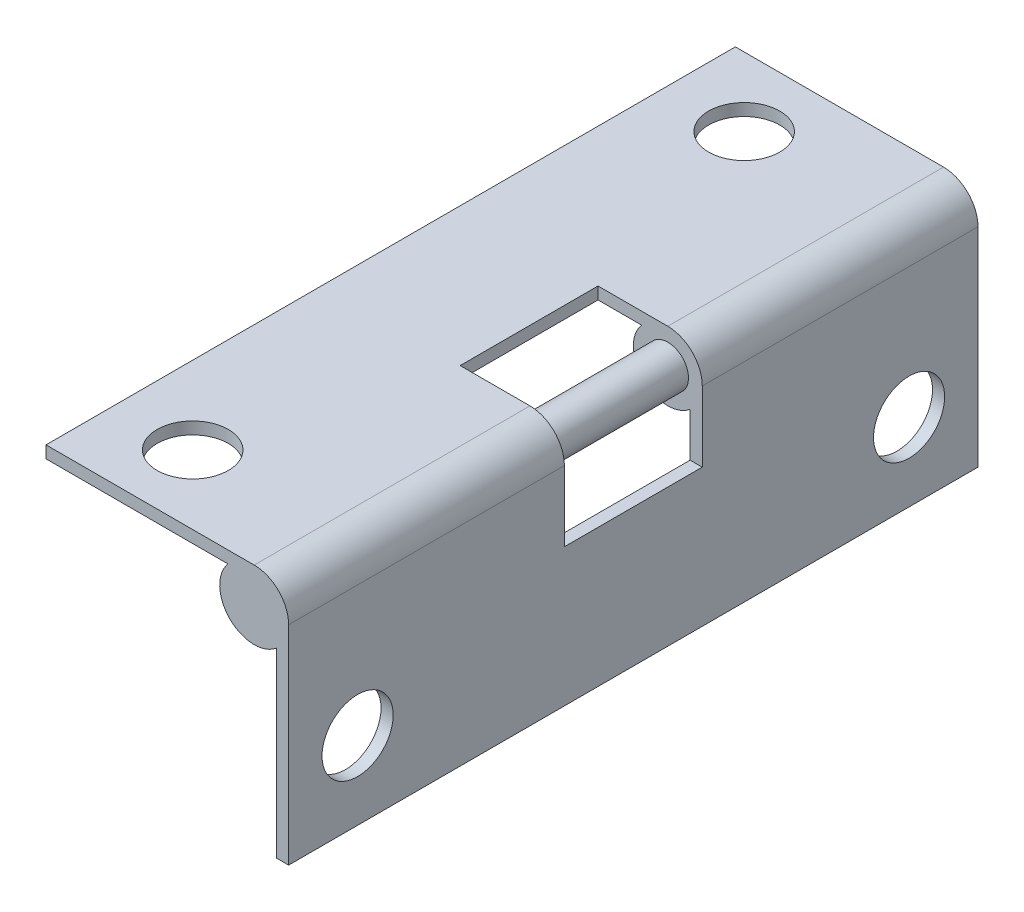
ISO-10303-21;
HEADER;
FILE_DESCRIPTION(('STEP AP214'),'2;1');
FILE_NAME('part.step','',(''),(''),'','','');
FILE_SCHEMA(('AUTOMOTIVE_DESIGN { 1 0 10303 214 1 1 1 1 }'));
ENDSEC;
DATA;
#1=APPLICATION_CONTEXT('core data for automotive mechanical design processes');
#2=APPLICATION_PROTOCOL_DEFINITION('international standard','automotive_design',2000,#1);
#3=PRODUCT_CONTEXT('',#1,'mechanical');
#4=PRODUCT('Part','Part','',(#3));
#5=PRODUCT_RELATED_PRODUCT_CATEGORY('part','',(#4));
#6=PRODUCT_DEFINITION_FORMATION('','',#4);
#7=PRODUCT_DEFINITION_CONTEXT('part definition',#1,'design');
#8=PRODUCT_DEFINITION('design','',#6,#7);
#9=PRODUCT_DEFINITION_SHAPE('','',#8);
#10=(LENGTH_UNIT() NAMED_UNIT(*) SI_UNIT(.MILLI.,.METRE.));
#11=(NAMED_UNIT(*) PLANE_ANGLE_UNIT() SI_UNIT($,.RADIAN.));
#12=(NAMED_UNIT(*) SI_UNIT($,.STERADIAN.) SOLID_ANGLE_UNIT());
#13=UNCERTAINTY_MEASURE_WITH_UNIT(LENGTH_MEASURE(1.E-05),#10,'distance_accuracy_value','');
#14=(GEOMETRIC_REPRESENTATION_CONTEXT(3) GLOBAL_UNCERTAINTY_ASSIGNED_CONTEXT((#13)) GLOBAL_UNIT_ASSIGNED_CONTEXT((#10,
#11,#12)) REPRESENTATION_CONTEXT('',''));
#15=CARTESIAN_POINT('',(0.,0.,0.));
#16=DIRECTION('',(0.,0.,1.));
#17=DIRECTION('',(1.,0.,0.));
#18=AXIS2_PLACEMENT_3D('',#15,#16,#17);
#19=CARTESIAN_POINT('',(0.,0.,31.75));
#20=DIRECTION('',(0.,0.,-1.));
#21=DIRECTION('',(-1.,0.,0.));
#22=AXIS2_PLACEMENT_3D('',#19,#20,#21);
#23=CYLINDRICAL_SURFACE('',#22,1.5875);
#24=CARTESIAN_POINT('',(0.,0.,12.7));
#25=DIRECTION('',(0.,0.,1.));
#26=DIRECTION('',(1.,0.,0.));
#27=AXIS2_PLACEMENT_3D('',#24,#25,#26);
#28=CIRCLE('',#27,1.5875);
#29=CARTESIAN_POINT('',(1.58749999999999,0.,12.7));
#30=VERTEX_POINT('',#29);
#31=CARTESIAN_POINT('',(0.,1.5875,12.7));
#32=VERTEX_POINT('',#31);
#33=EDGE_CURVE('E195',#30,#32,#28,.T.);
#34=ORIENTED_EDGE('',*,*,#33,.F.);
#35=DIRECTION('',(0.,0.,-1.));
#36=VECTOR('',#35,1.);
#37=CARTESIAN_POINT('',(1.5875,0.,31.75));
#38=LINE('',#37,#36);
#39=CARTESIAN_POINT('',(1.5875,0.,0.));
#40=VERTEX_POINT('',#39);
#41=EDGE_CURVE('E166',#30,#40,#38,.T.);
#42=ORIENTED_EDGE('',*,*,#41,.T.);
#43=CARTESIAN_POINT('',(0.,0.,0.));
#44=DIRECTION('',(0.,0.,1.));
#45=DIRECTION('',(1.,0.,0.));
#46=AXIS2_PLACEMENT_3D('',#43,#44,#45);
#47=CIRCLE('',#46,1.5875);
#48=CARTESIAN_POINT('',(0.,1.5875,0.));
#49=VERTEX_POINT('',#48);
#50=EDGE_CURVE('E216',#40,#49,#47,.T.);
#51=ORIENTED_EDGE('',*,*,#50,.T.);
#52=DIRECTION('',(0.,0.,-1.));
#53=VECTOR('',#52,1.);
#54=CARTESIAN_POINT('',(0.,1.5875,31.75));
#55=LINE('',#54,#53);
#56=EDGE_CURVE('E258',#32,#49,#55,.T.);
#57=ORIENTED_EDGE('',*,*,#56,.F.);
#58=EDGE_LOOP('',(#34,#42,#51,#57));
#59=FACE_BOUND('',#58,.T.);
#60=ADVANCED_FACE('F36',(#59),#23,.T.);
#61=CARTESIAN_POINT('',(0.,1.5875,31.75));
#62=DIRECTION('',(0.,-1.,0.));
#63=DIRECTION('',(1.,0.,0.));
#64=AXIS2_PLACEMENT_3D('',#61,#62,#63);
#65=PLANE('',#64);
#66=CARTESIAN_POINT('',(-6.0071,1.5875,28.575));
#67=DIRECTION('',(0.,1.,0.));
#68=DIRECTION('',(-1.,0.,0.));
#69=AXIS2_PLACEMENT_3D('',#66,#67,#68);
#70=CIRCLE('',#69,1.6383);
#71=CARTESIAN_POINT('',(-7.6454,1.5875,28.575));
#72=VERTEX_POINT('',#71);
#73=EDGE_CURVE('E178',#72,#72,#70,.T.);
#74=ORIENTED_EDGE('',*,*,#73,.F.);
#75=EDGE_LOOP('',(#74));
#76=FACE_BOUND('',#75,.T.);
#77=CARTESIAN_POINT('',(-6.0071,1.5875,3.175));
#78=DIRECTION('',(0.,1.,0.));
#79=DIRECTION('',(-1.,0.,0.));
#80=AXIS2_PLACEMENT_3D('',#77,#78,#79);
#81=CIRCLE('',#80,1.6383);
#82=CARTESIAN_POINT('',(-7.6454,1.5875,3.175));
#83=VERTEX_POINT('',#82);
#84=EDGE_CURVE('E169',#83,#83,#81,.T.);
#85=ORIENTED_EDGE('',*,*,#84,.F.);
#86=EDGE_LOOP('',(#85));
#87=FACE_BOUND('',#86,.T.);
#88=DIRECTION('',(1.,0.,0.));
#89=VECTOR('',#88,1.);
#90=CARTESIAN_POINT('',(0.,1.5875,12.7));
#91=LINE('',#90,#89);
#92=CARTESIAN_POINT('',(-3.2131,1.5875,12.7));
#93=VERTEX_POINT('',#92);
#94=EDGE_CURVE('E332',#93,#32,#91,.T.);
#95=ORIENTED_EDGE('',*,*,#94,.T.);
#96=ORIENTED_EDGE('',*,*,#56,.T.);
#97=DIRECTION('',(-1.,0.,0.));
#98=VECTOR('',#97,1.);
#99=CARTESIAN_POINT('',(0.,1.5875,0.));
#100=LINE('',#99,#98);
#101=CARTESIAN_POINT('',(-9.5885,1.5875,0.));
#102=VERTEX_POINT('',#101);
#103=EDGE_CURVE('E219',#49,#102,#100,.T.);
#104=ORIENTED_EDGE('',*,*,#103,.T.);
#105=DIRECTION('',(0.,0.,-1.));
#106=VECTOR('',#105,1.);
#107=CARTESIAN_POINT('',(-9.5885,1.5875,31.75));
#108=LINE('',#107,#106);
#109=CARTESIAN_POINT('',(-9.5885,1.5875,31.75));
#110=VERTEX_POINT('',#109);
#111=EDGE_CURVE('E255',#110,#102,#108,.T.);
#112=ORIENTED_EDGE('',*,*,#111,.F.);
#113=DIRECTION('',(-1.,0.,0.));
#114=VECTOR('',#113,1.);
#115=CARTESIAN_POINT('',(0.,1.5875,31.75));
#116=LINE('',#115,#114);
#117=CARTESIAN_POINT('',(0.,1.5875,31.75));
#118=VERTEX_POINT('',#117);
#119=EDGE_CURVE('E201',#118,#110,#116,.T.);
#120=ORIENTED_EDGE('',*,*,#119,.F.);
#121=CARTESIAN_POINT('',(0.,1.5875,19.05));
#122=VERTEX_POINT('',#121);
#123=EDGE_CURVE('E259',#118,#122,#55,.T.);
#124=ORIENTED_EDGE('',*,*,#123,.T.);
#125=DIRECTION('',(1.,0.,0.));
#126=VECTOR('',#125,1.);
#127=CARTESIAN_POINT('',(0.,1.5875,19.05));
#128=LINE('',#127,#126);
#129=CARTESIAN_POINT('',(-3.2131,1.5875,19.05));
#130=VERTEX_POINT('',#129);
#131=EDGE_CURVE('E338',#130,#122,#128,.T.);
#132=ORIENTED_EDGE('',*,*,#131,.F.);
#133=DIRECTION('',(0.,0.,1.));
#134=VECTOR('',#133,1.);
#135=CARTESIAN_POINT('',(-3.21310000000001,1.5875,0.));
#136=LINE('',#135,#134);
#137=EDGE_CURVE('E337',#93,#130,#136,.T.);
#138=ORIENTED_EDGE('',*,*,#137,.F.);
#139=EDGE_LOOP('',(#95,#96,#104,#112,#120,#124,#132,#138));
#140=FACE_BOUND('',#139,.T.);
#141=ADVANCED_FACE('F288',(#76,#87,#140),#65,.F.);
#142=CARTESIAN_POINT('',(-9.5885,1.0287,31.75));
#143=DIRECTION('',(0.,1.,0.));
#144=DIRECTION('',(-1.,0.,0.));
#145=AXIS2_PLACEMENT_3D('',#142,#143,#144);
#146=PLANE('',#145);
#147=CARTESIAN_POINT('',(-6.0071,1.0287,28.575));
#148=DIRECTION('',(0.,1.,0.));
#149=DIRECTION('',(-1.,0.,0.));
#150=AXIS2_PLACEMENT_3D('',#147,#148,#149);
#151=CIRCLE('',#150,1.6383);
#152=CARTESIAN_POINT('',(-7.6454,1.0287,28.575));
#153=VERTEX_POINT('',#152);
#154=EDGE_CURVE('E220',#153,#153,#151,.T.);
#155=ORIENTED_EDGE('',*,*,#154,.T.);
#156=EDGE_LOOP('',(#155));
#157=FACE_BOUND('',#156,.T.);
#158=CARTESIAN_POINT('',(-6.0071,1.0287,3.175));
#159=DIRECTION('',(0.,1.,0.));
#160=DIRECTION('',(-1.,0.,0.));
#161=AXIS2_PLACEMENT_3D('',#158,#159,#160);
#162=CIRCLE('',#161,1.6383);
#163=CARTESIAN_POINT('',(-7.6454,1.0287,3.175));
#164=VERTEX_POINT('',#163);
#165=EDGE_CURVE('E197',#164,#164,#162,.T.);
#166=ORIENTED_EDGE('',*,*,#165,.T.);
#167=EDGE_LOOP('',(#166));
#168=FACE_BOUND('',#167,.T.);
#169=DIRECTION('',(1.,0.,0.));
#170=VECTOR('',#169,1.);
#171=CARTESIAN_POINT('',(-9.5885,1.0287,12.7));
#172=LINE('',#171,#170);
#173=CARTESIAN_POINT('',(-3.2131,1.0287,12.7));
#174=VERTEX_POINT('',#173);
#175=CARTESIAN_POINT('',(-1.20910403191785,1.0287,12.7));
#176=VERTEX_POINT('',#175);
#177=EDGE_CURVE('E193',#174,#176,#172,.T.);
#178=ORIENTED_EDGE('',*,*,#177,.F.);
#179=DIRECTION('',(0.,0.,1.));
#180=VECTOR('',#179,1.);
#181=CARTESIAN_POINT('',(-3.2131,1.0287,31.75));
#182=LINE('',#181,#180);
#183=CARTESIAN_POINT('',(-3.2131,1.0287,19.05));
#184=VERTEX_POINT('',#183);
#185=EDGE_CURVE('E44',#174,#184,#182,.T.);
#186=ORIENTED_EDGE('',*,*,#185,.T.);
#187=DIRECTION('',(1.,0.,0.));
#188=VECTOR('',#187,1.);
#189=CARTESIAN_POINT('',(-9.5885,1.0287,19.05));
#190=LINE('',#189,#188);
#191=CARTESIAN_POINT('',(-1.20910403191785,1.0287,19.05));
#192=VERTEX_POINT('',#191);
#193=EDGE_CURVE('E184',#184,#192,#190,.T.);
#194=ORIENTED_EDGE('',*,*,#193,.T.);
#195=DIRECTION('',(0.,0.,-1.));
#196=VECTOR('',#195,1.);
#197=CARTESIAN_POINT('',(-1.20910403191785,1.0287,31.75));
#198=LINE('',#197,#196);
#199=CARTESIAN_POINT('',(-1.20910403191785,1.0287,31.75));
#200=VERTEX_POINT('',#199);
#201=EDGE_CURVE('E249',#200,#192,#198,.T.);
#202=ORIENTED_EDGE('',*,*,#201,.F.);
#203=DIRECTION('',(1.,0.,0.));
#204=VECTOR('',#203,1.);
#205=CARTESIAN_POINT('',(-9.5885,1.0287,31.75));
#206=LINE('',#205,#204);
#207=CARTESIAN_POINT('',(-9.5885,1.0287,31.75));
#208=VERTEX_POINT('',#207);
#209=EDGE_CURVE('E206',#208,#200,#206,.T.);
#210=ORIENTED_EDGE('',*,*,#209,.F.);
#211=DIRECTION('',(0.,0.,-1.));
#212=VECTOR('',#211,1.);
#213=CARTESIAN_POINT('',(-9.5885,1.0287,31.75));
#214=LINE('',#213,#212);
#215=CARTESIAN_POINT('',(-9.5885,1.0287,0.));
#216=VERTEX_POINT('',#215);
#217=EDGE_CURVE('E252',#208,#216,#214,.T.);
#218=ORIENTED_EDGE('',*,*,#217,.T.);
#219=DIRECTION('',(1.,0.,0.));
#220=VECTOR('',#219,1.);
#221=CARTESIAN_POINT('',(-9.5885,1.0287,0.));
#222=LINE('',#221,#220);
#223=CARTESIAN_POINT('',(-1.20910403191785,1.0287,0.));
#224=VERTEX_POINT('',#223);
#225=EDGE_CURVE('E224',#216,#224,#222,.T.);
#226=ORIENTED_EDGE('',*,*,#225,.T.);
#227=EDGE_CURVE('E248',#176,#224,#198,.T.);
#228=ORIENTED_EDGE('',*,*,#227,.F.);
#229=EDGE_LOOP('',(#178,#186,#194,#202,#210,#218,#226,#228));
#230=FACE_BOUND('',#229,.T.);
#231=ADVANCED_FACE('F268',(#157,#168,#230),#146,.F.);
#232=CARTESIAN_POINT('',(0.,0.,31.75));
#233=DIRECTION('',(0.,0.,-1.));
#234=DIRECTION('',(-1.,0.,0.));
#235=AXIS2_PLACEMENT_3D('',#232,#233,#234);
#236=CYLINDRICAL_SURFACE('',#235,1.5875);
#237=CARTESIAN_POINT('',(0.,0.,12.7));
#238=DIRECTION('',(0.,0.,1.));
#239=DIRECTION('',(1.,0.,0.));
#240=AXIS2_PLACEMENT_3D('',#237,#238,#239);
#241=CIRCLE('',#240,1.5875);
#242=CARTESIAN_POINT('',(1.0287,-1.20910403191785,12.7));
#243=VERTEX_POINT('',#242);
#244=EDGE_CURVE('E191',#176,#243,#241,.T.);
#245=ORIENTED_EDGE('',*,*,#244,.F.);
#246=ORIENTED_EDGE('',*,*,#227,.T.);
#247=CARTESIAN_POINT('',(0.,0.,0.));
#248=DIRECTION('',(0.,0.,1.));
#249=DIRECTION('',(1.,0.,0.));
#250=AXIS2_PLACEMENT_3D('',#247,#248,#249);
#251=CIRCLE('',#250,1.5875);
#252=CARTESIAN_POINT('',(1.0287,-1.20910403191785,0.));
#253=VERTEX_POINT('',#252);
#254=EDGE_CURVE('E227',#224,#253,#251,.T.);
#255=ORIENTED_EDGE('',*,*,#254,.T.);
#256=DIRECTION('',(0.,0.,-1.));
#257=VECTOR('',#256,1.);
#258=CARTESIAN_POINT('',(1.0287,-1.20910403191785,31.75));
#259=LINE('',#258,#257);
#260=EDGE_CURVE('E244',#243,#253,#259,.T.);
#261=ORIENTED_EDGE('',*,*,#260,.F.);
#262=EDGE_LOOP('',(#245,#246,#255,#261));
#263=FACE_BOUND('',#262,.T.);
#264=ADVANCED_FACE('F387',(#263),#236,.T.);
#265=CARTESIAN_POINT('',(1.0287,-9.5885,31.75));
#266=DIRECTION('',(1.,0.,0.));
#267=DIRECTION('',(0.,0.,-1.));
#268=AXIS2_PLACEMENT_3D('',#265,#266,#267);
#269=PLANE('',#268);
#270=CARTESIAN_POINT('',(1.0287,-6.0071,28.575));
#271=DIRECTION('',(1.,0.,0.));
#272=DIRECTION('',(0.,0.,-1.));
#273=AXIS2_PLACEMENT_3D('',#270,#271,#272);
#274=CIRCLE('',#273,1.6383);
#275=CARTESIAN_POINT('',(1.0287,-6.0071,26.9367));
#276=VERTEX_POINT('',#275);
#277=EDGE_CURVE('E342',#276,#276,#274,.T.);
#278=ORIENTED_EDGE('',*,*,#277,.T.);
#279=EDGE_LOOP('',(#278));
#280=FACE_BOUND('',#279,.T.);
#281=CARTESIAN_POINT('',(1.0287,-6.0071,3.175));
#282=DIRECTION('',(1.,0.,0.));
#283=DIRECTION('',(0.,0.,-1.));
#284=AXIS2_PLACEMENT_3D('',#281,#282,#283);
#285=CIRCLE('',#284,1.6383);
#286=CARTESIAN_POINT('',(1.0287,-6.0071,1.5367));
#287=VERTEX_POINT('',#286);
#288=EDGE_CURVE('E349',#287,#287,#285,.T.);
#289=ORIENTED_EDGE('',*,*,#288,.T.);
#290=EDGE_LOOP('',(#289));
#291=FACE_BOUND('',#290,.T.);
#292=DIRECTION('',(0.,-1.,0.));
#293=VECTOR('',#292,1.);
#294=CARTESIAN_POINT('',(1.0287,-9.5885,12.7));
#295=LINE('',#294,#293);
#296=CARTESIAN_POINT('',(1.0287,-3.2385,12.7));
#297=VERTEX_POINT('',#296);
#298=EDGE_CURVE('E153',#243,#297,#295,.T.);
#299=ORIENTED_EDGE('',*,*,#298,.F.);
#300=ORIENTED_EDGE('',*,*,#260,.T.);
#301=DIRECTION('',(0.,-1.,0.));
#302=VECTOR('',#301,1.);
#303=CARTESIAN_POINT('',(1.0287,-9.5885,0.));
#304=LINE('',#303,#302);
#305=CARTESIAN_POINT('',(1.0287,-9.5885,0.));
#306=VERTEX_POINT('',#305);
#307=EDGE_CURVE('E230',#253,#306,#304,.T.);
#308=ORIENTED_EDGE('',*,*,#307,.T.);
#309=DIRECTION('',(0.,0.,-1.));
#310=VECTOR('',#309,1.);
#311=CARTESIAN_POINT('',(1.0287,-9.5885,31.75));
#312=LINE('',#311,#310);
#313=CARTESIAN_POINT('',(1.0287,-9.5885,31.75));
#314=VERTEX_POINT('',#313);
#315=EDGE_CURVE('E241',#314,#306,#312,.T.);
#316=ORIENTED_EDGE('',*,*,#315,.F.);
#317=DIRECTION('',(0.,-1.,0.));
#318=VECTOR('',#317,1.);
#319=CARTESIAN_POINT('',(1.0287,-9.5885,31.75));
#320=LINE('',#319,#318);
#321=CARTESIAN_POINT('',(1.0287,-1.20910403191785,31.75));
#322=VERTEX_POINT('',#321);
#323=EDGE_CURVE('E210',#322,#314,#320,.T.);
#324=ORIENTED_EDGE('',*,*,#323,.F.);
#325=CARTESIAN_POINT('',(1.0287,-1.20910403191785,19.05));
#326=VERTEX_POINT('',#325);
#327=EDGE_CURVE('E245',#322,#326,#259,.T.);
#328=ORIENTED_EDGE('',*,*,#327,.T.);
#329=DIRECTION('',(0.,-1.,0.));
#330=VECTOR('',#329,1.);
#331=CARTESIAN_POINT('',(1.0287,-9.5885,19.05));
#332=LINE('',#331,#330);
#333=CARTESIAN_POINT('',(1.0287,-3.2385,19.05));
#334=VERTEX_POINT('',#333);
#335=EDGE_CURVE('E177',#326,#334,#332,.T.);
#336=ORIENTED_EDGE('',*,*,#335,.T.);
#337=DIRECTION('',(0.,0.,1.));
#338=VECTOR('',#337,1.);
#339=CARTESIAN_POINT('',(1.0287,-3.2385,31.75));
#340=LINE('',#339,#338);
#341=EDGE_CURVE('E175',#297,#334,#340,.T.);
#342=ORIENTED_EDGE('',*,*,#341,.F.);
#343=EDGE_LOOP('',(#299,#300,#308,#316,#324,#328,#336,#342));
#344=FACE_BOUND('',#343,.T.);
#345=ADVANCED_FACE('F304',(#280,#291,#344),#269,.F.);
#346=CARTESIAN_POINT('',(1.5875,0.,31.75));
#347=DIRECTION('',(-1.,0.,0.));
#348=DIRECTION('',(0.,-1.,0.));
#349=AXIS2_PLACEMENT_3D('',#346,#347,#348);
#350=PLANE('',#349);
#351=CARTESIAN_POINT('',(1.5875,-6.0071,28.575));
#352=DIRECTION('',(1.,0.,0.));
#353=DIRECTION('',(0.,1.,0.));
#354=AXIS2_PLACEMENT_3D('',#351,#352,#353);
#355=CIRCLE('',#354,1.6383);
#356=CARTESIAN_POINT('',(1.5875,-4.3688,28.575));
#357=VERTEX_POINT('',#356);
#358=EDGE_CURVE('E352',#357,#357,#355,.T.);
#359=ORIENTED_EDGE('',*,*,#358,.F.);
#360=EDGE_LOOP('',(#359));
#361=FACE_BOUND('',#360,.T.);
#362=CARTESIAN_POINT('',(1.5875,-6.0071,3.175));
#363=DIRECTION('',(1.,0.,0.));
#364=DIRECTION('',(0.,1.,0.));
#365=AXIS2_PLACEMENT_3D('',#362,#363,#364);
#366=CIRCLE('',#365,1.6383);
#367=CARTESIAN_POINT('',(1.5875,-4.3688,3.175));
#368=VERTEX_POINT('',#367);
#369=EDGE_CURVE('E353',#368,#368,#366,.T.);
#370=ORIENTED_EDGE('',*,*,#369,.F.);
#371=EDGE_LOOP('',(#370));
#372=FACE_BOUND('',#371,.T.);
#373=DIRECTION('',(0.,1.,0.));
#374=VECTOR('',#373,1.);
#375=CARTESIAN_POINT('',(1.5875,-3.2385,12.7));
#376=LINE('',#375,#374);
#377=CARTESIAN_POINT('',(1.5875,-3.2385,12.7));
#378=VERTEX_POINT('',#377);
#379=EDGE_CURVE('E150',#378,#30,#376,.T.);
#380=ORIENTED_EDGE('',*,*,#379,.F.);
#381=DIRECTION('',(0.,0.,1.));
#382=VECTOR('',#381,1.);
#383=CARTESIAN_POINT('',(1.58749999999999,-3.2385,0.));
#384=LINE('',#383,#382);
#385=CARTESIAN_POINT('',(1.5875,-3.2385,19.05));
#386=VERTEX_POINT('',#385);
#387=EDGE_CURVE('E156',#378,#386,#384,.T.);
#388=ORIENTED_EDGE('',*,*,#387,.T.);
#389=DIRECTION('',(0.,1.,0.));
#390=VECTOR('',#389,1.);
#391=CARTESIAN_POINT('',(1.5875,-3.2385,19.05));
#392=LINE('',#391,#390);
#393=CARTESIAN_POINT('',(1.5875,0.,19.05));
#394=VERTEX_POINT('',#393);
#395=EDGE_CURVE('E59',#386,#394,#392,.T.);
#396=ORIENTED_EDGE('',*,*,#395,.T.);
#397=CARTESIAN_POINT('',(1.5875,0.,31.75));
#398=VERTEX_POINT('',#397);
#399=EDGE_CURVE('E235',#398,#394,#38,.T.);
#400=ORIENTED_EDGE('',*,*,#399,.F.);
#401=DIRECTION('',(0.,1.,0.));
#402=VECTOR('',#401,1.);
#403=CARTESIAN_POINT('',(1.5875,0.,31.75));
#404=LINE('',#403,#402);
#405=CARTESIAN_POINT('',(1.5875,-9.5885,31.75));
#406=VERTEX_POINT('',#405);
#407=EDGE_CURVE('E214',#406,#398,#404,.T.);
#408=ORIENTED_EDGE('',*,*,#407,.F.);
#409=DIRECTION('',(0.,0.,-1.));
#410=VECTOR('',#409,1.);
#411=CARTESIAN_POINT('',(1.5875,-9.5885,31.75));
#412=LINE('',#411,#410);
#413=CARTESIAN_POINT('',(1.5875,-9.5885,0.));
#414=VERTEX_POINT('',#413);
#415=EDGE_CURVE('E238',#406,#414,#412,.T.);
#416=ORIENTED_EDGE('',*,*,#415,.T.);
#417=DIRECTION('',(0.,1.,0.));
#418=VECTOR('',#417,1.);
#419=CARTESIAN_POINT('',(1.5875,0.,0.));
#420=LINE('',#419,#418);
#421=EDGE_CURVE('E202',#414,#40,#420,.T.);
#422=ORIENTED_EDGE('',*,*,#421,.T.);
#423=ORIENTED_EDGE('',*,*,#41,.F.);
#424=EDGE_LOOP('',(#380,#388,#396,#400,#408,#416,#422,#423));
#425=FACE_BOUND('',#424,.T.);
#426=ADVANCED_FACE('F164',(#361,#372,#425),#350,.F.);
#427=ORIENTED_EDGE('',*,*,#399,.T.);
#428=CARTESIAN_POINT('',(0.,0.,19.05));
#429=DIRECTION('',(0.,0.,1.));
#430=DIRECTION('',(1.,0.,0.));
#431=AXIS2_PLACEMENT_3D('',#428,#429,#430);
#432=CIRCLE('',#431,1.5875);
#433=EDGE_CURVE('E187',#394,#122,#432,.T.);
#434=ORIENTED_EDGE('',*,*,#433,.T.);
#435=ORIENTED_EDGE('',*,*,#123,.F.);
#436=CARTESIAN_POINT('',(0.,0.,31.75));
#437=DIRECTION('',(0.,0.,1.));
#438=DIRECTION('',(1.,0.,0.));
#439=AXIS2_PLACEMENT_3D('',#436,#437,#438);
#440=CIRCLE('',#439,1.5875);
#441=EDGE_CURVE('E198',#398,#118,#440,.T.);
#442=ORIENTED_EDGE('',*,*,#441,.F.);
#443=EDGE_LOOP('',(#427,#434,#435,#442));
#444=FACE_BOUND('',#443,.T.);
#445=ADVANCED_FACE('F38',(#444),#23,.T.);
#446=CARTESIAN_POINT('',(-9.5885,1.5875,31.75));
#447=DIRECTION('',(1.,0.,0.));
#448=DIRECTION('',(0.,0.,-1.));
#449=AXIS2_PLACEMENT_3D('',#446,#447,#448);
#450=PLANE('',#449);
#451=DIRECTION('',(0.,-1.,0.));
#452=VECTOR('',#451,1.);
#453=CARTESIAN_POINT('',(-9.5885,1.5875,0.));
#454=LINE('',#453,#452);
#455=EDGE_CURVE('E222',#102,#216,#454,.T.);
#456=ORIENTED_EDGE('',*,*,#455,.T.);
#457=ORIENTED_EDGE('',*,*,#217,.F.);
#458=DIRECTION('',(0.,-1.,0.));
#459=VECTOR('',#458,1.);
#460=CARTESIAN_POINT('',(-9.5885,1.5875,31.75));
#461=LINE('',#460,#459);
#462=EDGE_CURVE('E204',#110,#208,#461,.T.);
#463=ORIENTED_EDGE('',*,*,#462,.F.);
#464=ORIENTED_EDGE('',*,*,#111,.T.);
#465=EDGE_LOOP('',(#456,#457,#463,#464));
#466=FACE_BOUND('',#465,.T.);
#467=ADVANCED_FACE('F295',(#466),#450,.F.);
#468=ORIENTED_EDGE('',*,*,#201,.T.);
#469=CARTESIAN_POINT('',(0.,0.,19.05));
#470=DIRECTION('',(0.,0.,1.));
#471=DIRECTION('',(1.,0.,0.));
#472=AXIS2_PLACEMENT_3D('',#469,#470,#471);
#473=CIRCLE('',#472,1.5875);
#474=EDGE_CURVE('E181',#192,#326,#473,.T.);
#475=ORIENTED_EDGE('',*,*,#474,.T.);
#476=ORIENTED_EDGE('',*,*,#327,.F.);
#477=CARTESIAN_POINT('',(0.,0.,31.75));
#478=DIRECTION('',(0.,0.,1.));
#479=DIRECTION('',(1.,0.,0.));
#480=AXIS2_PLACEMENT_3D('',#477,#478,#479);
#481=CIRCLE('',#480,1.5875);
#482=EDGE_CURVE('E208',#200,#322,#481,.T.);
#483=ORIENTED_EDGE('',*,*,#482,.F.);
#484=EDGE_LOOP('',(#468,#475,#476,#483));
#485=FACE_BOUND('',#484,.T.);
#486=ADVANCED_FACE('F301',(#485),#236,.T.);
#487=CARTESIAN_POINT('',(1.5875,-9.5885,31.75));
#488=DIRECTION('',(0.,1.,0.));
#489=DIRECTION('',(0.,0.,1.));
#490=AXIS2_PLACEMENT_3D('',#487,#488,#489);
#491=PLANE('',#490);
#492=DIRECTION('',(1.,0.,0.));
#493=VECTOR('',#492,1.);
#494=CARTESIAN_POINT('',(1.5875,-9.5885,0.));
#495=LINE('',#494,#493);
#496=EDGE_CURVE('E232',#306,#414,#495,.T.);
#497=ORIENTED_EDGE('',*,*,#496,.T.);
#498=ORIENTED_EDGE('',*,*,#415,.F.);
#499=DIRECTION('',(1.,0.,0.));
#500=VECTOR('',#499,1.);
#501=CARTESIAN_POINT('',(1.5875,-9.5885,31.75));
#502=LINE('',#501,#500);
#503=EDGE_CURVE('E212',#314,#406,#502,.T.);
#504=ORIENTED_EDGE('',*,*,#503,.F.);
#505=ORIENTED_EDGE('',*,*,#315,.T.);
#506=EDGE_LOOP('',(#497,#498,#504,#505));
#507=FACE_BOUND('',#506,.T.);
#508=ADVANCED_FACE('F319',(#507),#491,.F.);
#509=CARTESIAN_POINT('',(0.,0.,31.75));
#510=DIRECTION('',(0.,0.,1.));
#511=DIRECTION('',(1.,0.,0.));
#512=AXIS2_PLACEMENT_3D('',#509,#510,#511);
#513=PLANE('',#512);
#514=ORIENTED_EDGE('',*,*,#441,.T.);
#515=ORIENTED_EDGE('',*,*,#119,.T.);
#516=ORIENTED_EDGE('',*,*,#462,.T.);
#517=ORIENTED_EDGE('',*,*,#209,.T.);
#518=ORIENTED_EDGE('',*,*,#482,.T.);
#519=ORIENTED_EDGE('',*,*,#323,.T.);
#520=ORIENTED_EDGE('',*,*,#503,.T.);
#521=ORIENTED_EDGE('',*,*,#407,.T.);
#522=EDGE_LOOP('',(#514,#515,#516,#517,#518,#519,#520,#521));
#523=FACE_BOUND('',#522,.T.);
#524=ADVANCED_FACE('F314',(#523),#513,.T.);
#525=CARTESIAN_POINT('',(0.,0.,0.));
#526=DIRECTION('',(0.,0.,1.));
#527=DIRECTION('',(1.,0.,0.));
#528=AXIS2_PLACEMENT_3D('',#525,#526,#527);
#529=PLANE('',#528);
#530=ORIENTED_EDGE('',*,*,#50,.F.);
#531=ORIENTED_EDGE('',*,*,#421,.F.);
#532=ORIENTED_EDGE('',*,*,#496,.F.);
#533=ORIENTED_EDGE('',*,*,#307,.F.);
#534=ORIENTED_EDGE('',*,*,#254,.F.);
#535=ORIENTED_EDGE('',*,*,#225,.F.);
#536=ORIENTED_EDGE('',*,*,#455,.F.);
#537=ORIENTED_EDGE('',*,*,#103,.F.);
#538=EDGE_LOOP('',(#530,#531,#532,#533,#534,#535,#536,#537));
#539=FACE_BOUND('',#538,.T.);
#540=ADVANCED_FACE('F324',(#539),#529,.F.);
#541=CARTESIAN_POINT('',(-3.21310000000001,-3.2385,0.));
#542=DIRECTION('',(-1.,0.,0.));
#543=DIRECTION('',(0.,0.,1.));
#544=AXIS2_PLACEMENT_3D('',#541,#542,#543);
#545=PLANE('',#544);
#546=DIRECTION('',(0.,1.,0.));
#547=VECTOR('',#546,1.);
#548=CARTESIAN_POINT('',(-3.2131,-3.2385,12.7));
#549=LINE('',#548,#547);
#550=EDGE_CURVE('E167',#174,#93,#549,.T.);
#551=ORIENTED_EDGE('',*,*,#550,.T.);
#552=ORIENTED_EDGE('',*,*,#137,.T.);
#553=DIRECTION('',(0.,1.,0.));
#554=VECTOR('',#553,1.);
#555=CARTESIAN_POINT('',(-3.2131,-3.2385,19.05));
#556=LINE('',#555,#554);
#557=EDGE_CURVE('E155',#184,#130,#556,.T.);
#558=ORIENTED_EDGE('',*,*,#557,.F.);
#559=ORIENTED_EDGE('',*,*,#185,.F.);
#560=EDGE_LOOP('',(#551,#552,#558,#559));
#561=FACE_BOUND('',#560,.T.);
#562=ADVANCED_FACE('F367',(#561),#545,.F.);
#563=CARTESIAN_POINT('',(0.,-3.2385,12.7));
#564=DIRECTION('',(0.,0.,1.));
#565=DIRECTION('',(1.,0.,0.));
#566=AXIS2_PLACEMENT_3D('',#563,#564,#565);
#567=PLANE('',#566);
#568=CARTESIAN_POINT('',(0.,0.,12.7));
#569=DIRECTION('',(0.,0.,1.));
#570=DIRECTION('',(1.,0.,0.));
#571=AXIS2_PLACEMENT_3D('',#568,#569,#570);
#572=CIRCLE('',#571,0.9525);
#573=CARTESIAN_POINT('',(0.9525,0.,12.7));
#574=VERTEX_POINT('',#573);
#575=EDGE_CURVE('E356',#574,#574,#572,.T.);
#576=ORIENTED_EDGE('',*,*,#575,.F.);
#577=EDGE_LOOP('',(#576));
#578=FACE_BOUND('',#577,.T.);
#579=ORIENTED_EDGE('',*,*,#33,.T.);
#580=ORIENTED_EDGE('',*,*,#94,.F.);
#581=ORIENTED_EDGE('',*,*,#550,.F.);
#582=ORIENTED_EDGE('',*,*,#177,.T.);
#583=ORIENTED_EDGE('',*,*,#244,.T.);
#584=ORIENTED_EDGE('',*,*,#298,.T.);
#585=DIRECTION('',(1.,0.,0.));
#586=VECTOR('',#585,1.);
#587=CARTESIAN_POINT('',(0.,-3.2385,12.7));
#588=LINE('',#587,#586);
#589=EDGE_CURVE('E51',#297,#378,#588,.T.);
#590=ORIENTED_EDGE('',*,*,#589,.T.);
#591=ORIENTED_EDGE('',*,*,#379,.T.);
#592=EDGE_LOOP('',(#579,#580,#581,#582,#583,#584,#590,#591));
#593=FACE_BOUND('',#592,.T.);
#594=ADVANCED_FACE('F148',(#578,#593),#567,.T.);
#595=CARTESIAN_POINT('',(0.,-3.2385,19.05));
#596=DIRECTION('',(0.,0.,1.));
#597=DIRECTION('',(1.,0.,0.));
#598=AXIS2_PLACEMENT_3D('',#595,#596,#597);
#599=PLANE('',#598);
#600=CARTESIAN_POINT('',(0.,0.,19.05));
#601=DIRECTION('',(0.,0.,1.));
#602=DIRECTION('',(1.,0.,0.));
#603=AXIS2_PLACEMENT_3D('',#600,#601,#602);
#604=CIRCLE('',#603,0.9525);
#605=CARTESIAN_POINT('',(0.9525,0.,19.05));
#606=VERTEX_POINT('',#605);
#607=EDGE_CURVE('E11',#606,#606,#604,.F.);
#608=ORIENTED_EDGE('',*,*,#607,.F.);
#609=EDGE_LOOP('',(#608));
#610=FACE_BOUND('',#609,.T.);
#611=ORIENTED_EDGE('',*,*,#395,.F.);
#612=DIRECTION('',(1.,0.,0.));
#613=VECTOR('',#612,1.);
#614=CARTESIAN_POINT('',(0.,-3.2385,19.05));
#615=LINE('',#614,#613);
#616=EDGE_CURVE('E160',#334,#386,#615,.T.);
#617=ORIENTED_EDGE('',*,*,#616,.F.);
#618=ORIENTED_EDGE('',*,*,#335,.F.);
#619=ORIENTED_EDGE('',*,*,#474,.F.);
#620=ORIENTED_EDGE('',*,*,#193,.F.);
#621=ORIENTED_EDGE('',*,*,#557,.T.);
#622=ORIENTED_EDGE('',*,*,#131,.T.);
#623=ORIENTED_EDGE('',*,*,#433,.F.);
#624=EDGE_LOOP('',(#611,#617,#618,#619,#620,#621,#622,#623));
#625=FACE_BOUND('',#624,.T.);
#626=ADVANCED_FACE('F366',(#610,#625),#599,.F.);
#627=CARTESIAN_POINT('',(0.,-3.2385,0.));
#628=DIRECTION('',(0.,1.,0.));
#629=DIRECTION('',(-1.,0.,0.));
#630=AXIS2_PLACEMENT_3D('',#627,#628,#629);
#631=PLANE('',#630);
#632=ORIENTED_EDGE('',*,*,#341,.T.);
#633=ORIENTED_EDGE('',*,*,#616,.T.);
#634=ORIENTED_EDGE('',*,*,#387,.F.);
#635=ORIENTED_EDGE('',*,*,#589,.F.);
#636=EDGE_LOOP('',(#632,#633,#634,#635));
#637=FACE_BOUND('',#636,.T.);
#638=ADVANCED_FACE('F159',(#637),#631,.T.);
#639=CARTESIAN_POINT('',(-6.0071,-3.2385,3.175));
#640=DIRECTION('',(0.,1.,0.));
#641=DIRECTION('',(-1.,0.,0.));
#642=AXIS2_PLACEMENT_3D('',#639,#640,#641);
#643=CYLINDRICAL_SURFACE('',#642,1.6383);
#644=ORIENTED_EDGE('',*,*,#84,.T.);
#645=EDGE_LOOP('',(#644));
#646=FACE_BOUND('',#645,.T.);
#647=ORIENTED_EDGE('',*,*,#165,.F.);
#648=EDGE_LOOP('',(#647));
#649=FACE_BOUND('',#648,.T.);
#650=ADVANCED_FACE('F274',(#646,#649),#643,.F.);
#651=CARTESIAN_POINT('',(-6.0071,-3.2385,28.575));
#652=DIRECTION('',(0.,1.,0.));
#653=DIRECTION('',(-1.,0.,0.));
#654=AXIS2_PLACEMENT_3D('',#651,#652,#653);
#655=CYLINDRICAL_SURFACE('',#654,1.6383);
#656=ORIENTED_EDGE('',*,*,#73,.T.);
#657=EDGE_LOOP('',(#656));
#658=FACE_BOUND('',#657,.T.);
#659=ORIENTED_EDGE('',*,*,#154,.F.);
#660=EDGE_LOOP('',(#659));
#661=FACE_BOUND('',#660,.T.);
#662=ADVANCED_FACE('F271',(#658,#661),#655,.F.);
#663=CARTESIAN_POINT('',(-9.5885,-6.0071,3.175));
#664=DIRECTION('',(1.,0.,0.));
#665=DIRECTION('',(0.,1.,0.));
#666=AXIS2_PLACEMENT_3D('',#663,#664,#665);
#667=CYLINDRICAL_SURFACE('',#666,1.6383);
#668=ORIENTED_EDGE('',*,*,#369,.T.);
#669=EDGE_LOOP('',(#668));
#670=FACE_BOUND('',#669,.T.);
#671=ORIENTED_EDGE('',*,*,#288,.F.);
#672=EDGE_LOOP('',(#671));
#673=FACE_BOUND('',#672,.T.);
#674=ADVANCED_FACE('F273',(#670,#673),#667,.F.);
#675=CARTESIAN_POINT('',(-9.5885,-6.0071,28.575));
#676=DIRECTION('',(1.,0.,0.));
#677=DIRECTION('',(0.,1.,0.));
#678=AXIS2_PLACEMENT_3D('',#675,#676,#677);
#679=CYLINDRICAL_SURFACE('',#678,1.6383);
#680=ORIENTED_EDGE('',*,*,#358,.T.);
#681=EDGE_LOOP('',(#680));
#682=FACE_BOUND('',#681,.T.);
#683=ORIENTED_EDGE('',*,*,#277,.F.);
#684=EDGE_LOOP('',(#683));
#685=FACE_BOUND('',#684,.T.);
#686=ADVANCED_FACE('F281',(#682,#685),#679,.F.);
#687=CARTESIAN_POINT('',(0.,0.,-0.00199999999999853));
#688=DIRECTION('',(0.,0.,1.));
#689=DIRECTION('',(1.,0.,0.));
#690=AXIS2_PLACEMENT_3D('',#687,#688,#689);
#691=CYLINDRICAL_SURFACE('',#690,0.9525);
#692=ORIENTED_EDGE('',*,*,#575,.T.);
#693=EDGE_LOOP('',(#692));
#694=FACE_BOUND('',#693,.T.);
#695=ORIENTED_EDGE('',*,*,#607,.T.);
#696=EDGE_LOOP('',(#695));
#697=FACE_BOUND('',#696,.T.);
#698=ADVANCED_FACE('F362',(#694,#697),#691,.T.);
#699=CLOSED_SHELL('',(#60,#141,#231,#264,#345,#426,#445,#467,#486,#508,#524,#540,#562,#594,#626,
#638,#650,#662,#674,#686,#698));
#700=MANIFOLD_SOLID_BREP('B2',#699);
#701=ADVANCED_BREP_SHAPE_REPRESENTATION('',(#18,#700),#14);
#702=SHAPE_DEFINITION_REPRESENTATION(#9,#701);
ENDSEC;
END-ISO-10303-21;
